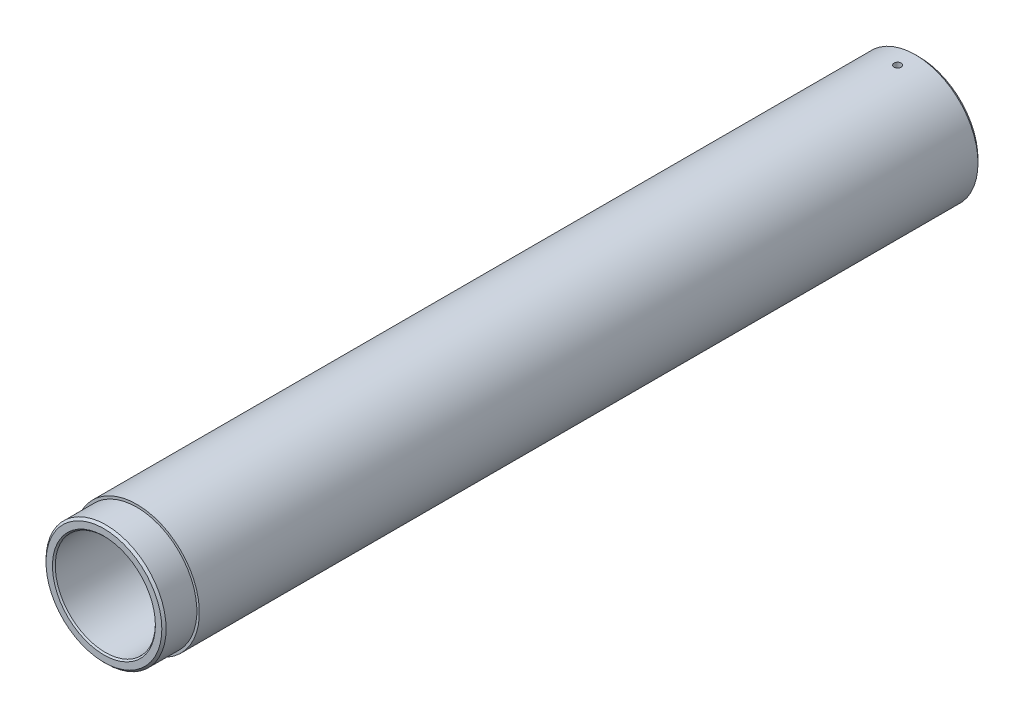
ISO-10303-21;
HEADER;
FILE_DESCRIPTION(('STEP AP214'),'2;1');
FILE_NAME('part.step','',(''),(''),'','','');
FILE_SCHEMA(('AUTOMOTIVE_DESIGN { 1 0 10303 214 1 1 1 1 }'));
ENDSEC;
DATA;
#1=APPLICATION_CONTEXT('core data for automotive mechanical design processes');
#2=APPLICATION_PROTOCOL_DEFINITION('international standard','automotive_design',2000,#1);
#3=PRODUCT_CONTEXT('',#1,'mechanical');
#4=PRODUCT('Part','Part','',(#3));
#5=PRODUCT_RELATED_PRODUCT_CATEGORY('part','',(#4));
#6=PRODUCT_DEFINITION_FORMATION('','',#4);
#7=PRODUCT_DEFINITION_CONTEXT('part definition',#1,'design');
#8=PRODUCT_DEFINITION('design','',#6,#7);
#9=PRODUCT_DEFINITION_SHAPE('','',#8);
#10=(LENGTH_UNIT() NAMED_UNIT(*) SI_UNIT(.MILLI.,.METRE.));
#11=(NAMED_UNIT(*) PLANE_ANGLE_UNIT() SI_UNIT($,.RADIAN.));
#12=(NAMED_UNIT(*) SI_UNIT($,.STERADIAN.) SOLID_ANGLE_UNIT());
#13=UNCERTAINTY_MEASURE_WITH_UNIT(LENGTH_MEASURE(1.E-05),#10,'distance_accuracy_value','');
#14=(GEOMETRIC_REPRESENTATION_CONTEXT(3) GLOBAL_UNCERTAINTY_ASSIGNED_CONTEXT((#13)) GLOBAL_UNIT_ASSIGNED_CONTEXT((#10,
#11,#12)) REPRESENTATION_CONTEXT('',''));
#15=CARTESIAN_POINT('',(0.,0.,0.));
#16=DIRECTION('',(0.,0.,1.));
#17=DIRECTION('',(1.,0.,0.));
#18=AXIS2_PLACEMENT_3D('',#15,#16,#17);
#19=CARTESIAN_POINT('',(0.,0.,570.));
#20=DIRECTION('',(0.,0.,-1.));
#21=DIRECTION('',(-1.,0.,0.));
#22=AXIS2_PLACEMENT_3D('',#19,#20,#21);
#23=CYLINDRICAL_SURFACE('',#22,87.5);
#24=CARTESIAN_POINT('',(0.,0.,524.));
#25=DIRECTION('',(0.,0.,-1.));
#26=DIRECTION('',(-1.,0.,0.));
#27=AXIS2_PLACEMENT_3D('',#24,#25,#26);
#28=CIRCLE('',#27,87.5);
#29=CARTESIAN_POINT('',(-87.5,0.,524.));
#30=VERTEX_POINT('',#29);
#31=EDGE_CURVE('E58',#30,#30,#28,.T.);
#32=ORIENTED_EDGE('',*,*,#31,.T.);
#33=EDGE_LOOP('',(#32));
#34=FACE_BOUND('',#33,.T.);
#35=CARTESIAN_POINT('',(0.,0.,-565.));
#36=DIRECTION('',(0.,0.,1.));
#37=DIRECTION('',(1.,0.,0.));
#38=AXIS2_PLACEMENT_3D('',#35,#36,#37);
#39=CIRCLE('',#38,87.5);
#40=CARTESIAN_POINT('',(87.5,0.,-565.));
#41=VERTEX_POINT('',#40);
#42=EDGE_CURVE('E65',#41,#41,#39,.T.);
#43=ORIENTED_EDGE('',*,*,#42,.T.);
#44=EDGE_LOOP('',(#43));
#45=FACE_BOUND('',#44,.T.);
#46=CARTESIAN_POINT('',(0.,87.5,-545.));
#47=CARTESIAN_POINT('',(-0.140353494550217,87.5000001774043,-545.000001124039));
#48=CARTESIAN_POINT('',(-0.280688984760301,87.4996615989778,-544.994087903597));
#49=CARTESIAN_POINT('',(-0.560407613455279,87.4983171222308,-544.970477140149));
#50=CARTESIAN_POINT('',(-0.699790499409025,87.4973110534035,-544.952776586127));
#51=CARTESIAN_POINT('',(-0.976683844110109,87.4946585732595,-544.905693568704));
#52=CARTESIAN_POINT('',(-1.11419258669591,87.4930116111499,-544.876301056581));
#53=CARTESIAN_POINT('',(-1.38628978360608,87.4891234424568,-544.806032748754));
#54=CARTESIAN_POINT('',(-1.52087715089463,87.4868820186418,-544.765152754901));
#55=CARTESIAN_POINT('',(-1.7860038916945,87.4818710139496,-544.672248253067));
#56=CARTESIAN_POINT('',(-1.91654675474242,87.4791019039896,-544.620233676731));
#57=CARTESIAN_POINT('',(-2.1728319210281,87.4731115202774,-544.505388606092));
#58=CARTESIAN_POINT('',(-2.29857243633945,87.4698900801691,-544.44255413056));
#59=CARTESIAN_POINT('',(-2.54423734439183,87.4630890673701,-544.306571164846));
#60=CARTESIAN_POINT('',(-2.66416519677498,87.4595097116922,-544.233428913634));
#61=CARTESIAN_POINT('',(-2.89748177823847,87.4520910554665,-544.077292049556));
#62=CARTESIAN_POINT('',(-3.01086807453722,87.4482516593499,-543.994293805929));
#63=CARTESIAN_POINT('',(-3.23033510419506,87.4404197373216,-543.818988660036));
#64=CARTESIAN_POINT('',(-3.33641027120848,87.4364270982611,-543.726674794225));
#65=CARTESIAN_POINT('',(-3.54044845710865,87.4284030249958,-543.533408816415));
#66=CARTESIAN_POINT('',(-3.63840846504481,87.4243715770056,-543.432453526203));
#67=CARTESIAN_POINT('',(-3.82544793728456,87.4163869654419,-543.222683407593));
#68=CARTESIAN_POINT('',(-3.91453029856233,87.4124337766704,-543.113871163215));
#69=CARTESIAN_POINT('',(-4.08325058983841,87.4047149841581,-542.889086513134));
#70=CARTESIAN_POINT('',(-4.16288502136678,87.4009494502014,-542.773111479146));
#71=CARTESIAN_POINT('',(-4.31212785487462,87.3937133880844,-542.534821899173));
#72=CARTESIAN_POINT('',(-4.38173321421385,87.3902429495811,-542.412505444555));
#73=CARTESIAN_POINT('',(-4.51041668601308,87.3836958117647,-542.162390199847));
#74=CARTESIAN_POINT('',(-4.5694908982243,87.3806192584469,-542.034589400262));
#75=CARTESIAN_POINT('',(-4.67663804600154,87.3749503227046,-541.774491795738));
#76=CARTESIAN_POINT('',(-4.72471511939977,87.3723577582402,-541.642196703433));
#77=CARTESIAN_POINT('',(-4.8095661786191,87.3677277405135,-541.374006233363));
#78=CARTESIAN_POINT('',(-4.84633599052424,87.3656904922698,-541.238109546178));
#79=CARTESIAN_POINT('',(-4.93913118657848,87.360511935829,-540.826860910999));
#80=CARTESIAN_POINT('',(-4.97787803270924,87.3582909187485,-540.547376653816));
#81=CARTESIAN_POINT('',(-5.00788652675383,87.3565753814524,-539.986014535367));
#82=CARTESIAN_POINT('',(-4.99914863810524,87.3570808346272,-539.704136697487));
#83=CARTESIAN_POINT('',(-4.93453967446561,87.3607540779416,-539.146151715721));
#84=CARTESIAN_POINT('',(-4.87872390909804,87.3639187438786,-538.87003818953));
#85=CARTESIAN_POINT('',(-4.72161290750819,87.3725500687875,-538.331116868728));
#86=CARTESIAN_POINT('',(-4.62031743532586,87.3780167397028,-538.068309143159));
#87=CARTESIAN_POINT('',(-4.37506384937826,87.3906392471769,-537.563268308152));
#88=CARTESIAN_POINT('',(-4.23108058156139,87.3977960791666,-537.321047438232));
#89=CARTESIAN_POINT('',(-3.9045556491673,87.4129914117525,-536.86419348496));
#90=CARTESIAN_POINT('',(-3.72201362461125,87.4210299205797,-536.649560659196));
#91=CARTESIAN_POINT('',(-3.32324131736048,87.4370965208609,-536.253652535492));
#92=CARTESIAN_POINT('',(-3.10696314154925,87.4451245808872,-536.072425472149));
#93=CARTESIAN_POINT('',(-2.64702587687849,87.4602544399251,-535.748845385997));
#94=CARTESIAN_POINT('',(-2.40336677983772,87.46735623866,-535.606492374802));
#95=CARTESIAN_POINT('',(-1.89555549675699,87.4798336994861,-535.364705530798));
#96=CARTESIAN_POINT('',(-1.63140247019284,87.4852092907333,-535.265273459417));
#97=CARTESIAN_POINT('',(-1.09011446967437,87.4936275597734,-535.112182929559));
#98=CARTESIAN_POINT('',(-0.812979622545285,87.4966702603522,-535.058524024001));
#99=CARTESIAN_POINT('',(-0.254013432563951,87.5000769266405,-534.998562621438));
#100=CARTESIAN_POINT('',(0.0278107330356192,87.5004446653747,-534.992193422197));
#101=CARTESIAN_POINT('',(0.588523611815352,87.4984699940475,-535.02681805084));
#102=CARTESIAN_POINT('',(0.867412337725762,87.4961275957442,-535.067811673238));
#103=CARTESIAN_POINT('',(1.41415026319905,87.4889988352532,-535.195943047866));
#104=CARTESIAN_POINT('',(1.68200664195568,87.4842140904479,-535.283050263948));
#105=CARTESIAN_POINT('',(2.19929779804261,87.4727391176563,-535.500905256772));
#106=CARTESIAN_POINT('',(2.4487324367336,87.4660488753315,-535.631653361909));
#107=CARTESIAN_POINT('',(2.92240543730271,87.4515056416428,-535.933248651841));
#108=CARTESIAN_POINT('',(3.14661534633045,87.4436513599519,-536.104140460145));
#109=CARTESIAN_POINT('',(3.56318801346395,87.4276685839583,-536.481108102829));
#110=CARTESIAN_POINT('',(3.75555050791195,87.4195400873861,-536.687184228463));
#111=CARTESIAN_POINT('',(4.10319360179103,87.4039141207669,-537.12895442646));
#112=CARTESIAN_POINT('',(4.25843098149149,87.3964173927112,-537.364682536329));
#113=CARTESIAN_POINT('',(4.52712021987337,87.3829123067106,-537.858907714874));
#114=CARTESIAN_POINT('',(4.64057230182332,87.3769039408131,-538.117404661882));
#115=CARTESIAN_POINT('',(4.82240092086781,87.3670577223577,-538.649618728996));
#116=CARTESIAN_POINT('',(4.89080481716648,87.3632185525794,-538.923326501335));
#117=CARTESIAN_POINT('',(4.98066406585461,87.3581427694404,-539.478517657249));
#118=CARTESIAN_POINT('',(5.00211979314427,87.3569061352975,-539.760000978715));
#119=CARTESIAN_POINT('',(4.99868835151569,87.3571004141498,-540.181450092026));
#120=CARTESIAN_POINT('',(4.99161313597053,87.3575064569968,-540.321778851262));
#121=CARTESIAN_POINT('',(4.96568948247667,87.3589842487839,-540.601327096313));
#122=CARTESIAN_POINT('',(4.94684539803986,87.3600557515579,-540.740546973044));
#123=CARTESIAN_POINT('',(4.89750474147686,87.3628356234173,-541.016942811073));
#124=CARTESIAN_POINT('',(4.86700386267354,87.3645442278783,-541.154117997462));
#125=CARTESIAN_POINT('',(4.79458459869491,87.3685485405066,-541.42536032351));
#126=CARTESIAN_POINT('',(4.75267041701051,87.3708440325058,-541.559428587753));
#127=CARTESIAN_POINT('',(4.65770108190452,87.3759582508288,-541.823603817628));
#128=CARTESIAN_POINT('',(4.6046418497217,87.3787771686672,-541.953709312987));
#129=CARTESIAN_POINT('',(4.48779192705564,87.3848564855314,-542.208939845635));
#130=CARTESIAN_POINT('',(4.42400518896496,87.3881167218738,-542.334066696312));
#131=CARTESIAN_POINT('',(4.2861167519848,87.3949882279554,-542.578547249043));
#132=CARTESIAN_POINT('',(4.21201157356913,87.3985996159835,-542.697898985274));
#133=CARTESIAN_POINT('',(4.05405763185545,87.4060687996387,-542.929898087627));
#134=CARTESIAN_POINT('',(3.97021245415048,87.409926504355,-543.042547897985));
#135=CARTESIAN_POINT('',(3.79320037441526,87.4177870346197,-543.260580000854));
#136=CARTESIAN_POINT('',(3.70001797174803,87.4217900942055,-543.365949701034));
#137=CARTESIAN_POINT('',(3.50514634048114,87.4298201564252,-543.56842894715));
#138=CARTESIAN_POINT('',(3.40346025200853,87.4338471497153,-543.665541515687));
#139=CARTESIAN_POINT('',(3.19220608866852,87.4418149234529,-543.850919455395));
#140=CARTESIAN_POINT('',(3.08263320831804,87.4457556493972,-543.939179352831));
#141=CARTESIAN_POINT('',(2.85647879558645,87.4534351680839,-544.106126645556));
#142=CARTESIAN_POINT('',(2.7398998631756,87.457174034771,-544.184817559549));
#143=CARTESIAN_POINT('',(2.50034444609276,87.4643507687863,-544.332214765239));
#144=CARTESIAN_POINT('',(2.3773587458016,87.467788182312,-544.400906102947));
#145=CARTESIAN_POINT('',(2.12606982304713,87.4742568815573,-544.527650954462));
#146=CARTESIAN_POINT('',(1.99776856396576,87.4772883155109,-544.585708353871));
#147=CARTESIAN_POINT('',(1.73682903814133,87.4828579489435,-544.690755453468));
#148=CARTESIAN_POINT('',(1.60419463651506,87.4853965746865,-544.737754726128));
#149=CARTESIAN_POINT('',(1.33547288403443,87.4899112686366,-544.820401731433));
#150=CARTESIAN_POINT('',(1.19938643096779,87.4918874815114,-544.856052383528));
#151=CARTESIAN_POINT('',(0.887753200527499,87.4956697720622,-544.923787487865));
#152=CARTESIAN_POINT('',(0.711425618028075,87.4972875701508,-544.952341906901));
#153=CARTESIAN_POINT('',(0.356722331786841,87.4994525707976,-544.990447438011));
#154=CARTESIAN_POINT('',(0.178346630373542,87.499999774573,-544.999998571688));
#155=CARTESIAN_POINT('',(0.,87.5,-545.));
#156=B_SPLINE_CURVE_WITH_KNOTS('',3,(#46,#47,#48,#49,#50,#51,#52,#53,#54,#55,#56,#57,#58,#59,
#60,#61,#62,#63,#64,#65,#66,#67,#68,#69,#70,#71,#72,#73,#74,#75,#76,#77,#78,#79,#80,#81,#82,#83,
#84,#85,#86,#87,#88,#89,#90,#91,#92,#93,#94,#95,#96,#97,#98,#99,#100,#101,#102,#103,#104,#105,
#106,#107,#108,#109,#110,#111,#112,#113,#114,#115,#116,#117,#118,#119,#120,#121,#122,#123,#124,
#125,#126,#127,#128,#129,#130,#131,#132,#133,#134,#135,#136,#137,#138,#139,#140,#141,#142,#143,
#144,#145,#146,#147,#148,#149,#150,#151,#152,#153,#154,#155),.UNSPECIFIED.,.T.,.F.,(4,2,2,2,2,2,
2,2,2,2,2,2,2,2,2,2,2,2,2,2,2,2,2,2,2,2,2,2,2,2,2,2,2,2,2,2,2,2,2,2,2,2,2,2,2,2,2,2,2,2,2,2,2,2,
4),(0.,0.420904645376287,0.841916850033855,1.2632916805754,1.68482070503997,2.10597529595064,
2.52728518496749,2.9483411549801,3.36955271799029,3.79108150771636,4.21276600237754,
4.63431243827221,5.05601448443104,5.47784419923929,5.89982981712417,6.32165639468539,
6.74363849717512,7.58576503284785,8.42788334961852,9.26901367634905,10.1101483671239,
10.9517796902503,11.793418871069,12.6362639353429,13.4791092514538,14.3219891537456,
15.1648608232818,16.0065433941856,16.8482223134227,17.6893445737594,18.5304731636138,
19.3725412089347,20.2146162252038,21.0576668343238,21.9007129387636,22.7432465609966,
23.5857734552318,24.0068866665485,24.4278441928636,24.8489573952092,25.2699157118976,
25.691028356227,26.1119861863089,26.533086314755,26.9540319116491,27.3756882728908,
27.7971896123011,28.2189499860274,28.6405547981074,29.0627837661643,29.4848581442184,
29.9065657980424,30.3281648790573,30.8630073551029,31.3978492231447),.UNSPECIFIED.);
#157=CARTESIAN_POINT('',(0.,87.5,-545.));
#158=VERTEX_POINT('',#157);
#159=EDGE_CURVE('E72',#158,#158,#156,.T.);
#160=ORIENTED_EDGE('',*,*,#159,.F.);
#161=EDGE_LOOP('',(#160));
#162=FACE_BOUND('',#161,.T.);
#163=ADVANCED_FACE('F32',(#34,#45,#162),#23,.T.);
#164=CARTESIAN_POINT('',(0.,0.,570.));
#165=DIRECTION('',(0.,0.,-1.));
#166=DIRECTION('',(-1.,0.,0.));
#167=AXIS2_PLACEMENT_3D('',#164,#165,#166);
#168=CYLINDRICAL_SURFACE('',#167,70.);
#169=CARTESIAN_POINT('',(0.,0.,-570.));
#170=DIRECTION('',(0.,0.,1.));
#171=DIRECTION('',(1.,0.,0.));
#172=AXIS2_PLACEMENT_3D('',#169,#170,#171);
#173=CIRCLE('',#172,70.);
#174=CARTESIAN_POINT('',(70.,0.,-570.));
#175=VERTEX_POINT('',#174);
#176=EDGE_CURVE('E61',#175,#175,#173,.T.);
#177=ORIENTED_EDGE('',*,*,#176,.F.);
#178=EDGE_LOOP('',(#177));
#179=FACE_BOUND('',#178,.T.);
#180=CARTESIAN_POINT('',(0.,0.,568.));
#181=DIRECTION('',(0.,0.,1.));
#182=DIRECTION('',(1.,0.,0.));
#183=AXIS2_PLACEMENT_3D('',#180,#181,#182);
#184=CIRCLE('',#183,70.);
#185=CARTESIAN_POINT('',(70.,0.,568.));
#186=VERTEX_POINT('',#185);
#187=EDGE_CURVE('E45',#186,#186,#184,.T.);
#188=ORIENTED_EDGE('',*,*,#187,.T.);
#189=EDGE_LOOP('',(#188));
#190=FACE_BOUND('',#189,.T.);
#191=CARTESIAN_POINT('',(0.,70.,-545.));
#192=CARTESIAN_POINT('',(-0.140284355117039,70.0000002339568,-545.000001191231));
#193=CARTESIAN_POINT('',(-0.280549882095459,69.9995774220994,-544.994093763169));
#194=CARTESIAN_POINT('',(-0.560128091603476,69.9978984856483,-544.97050660729));
#195=CARTESIAN_POINT('',(-0.699440525850233,69.9966421516901,-544.952823921755));
#196=CARTESIAN_POINT('',(-0.976190099008069,69.993329853636,-544.905789673813));
#197=CARTESIAN_POINT('',(-1.11362555564529,69.9912732154386,-544.876428273886));
#198=CARTESIAN_POINT('',(-1.38557657629033,69.9864178239072,-544.806236065325));
#199=CARTESIAN_POINT('',(-1.52009105309621,69.9836187992073,-544.765401062402));
#200=CARTESIAN_POINT('',(-1.78507058079349,69.9773611437192,-544.672602253431));
#201=CARTESIAN_POINT('',(-1.91553921432633,69.9739031170728,-544.620648635077));
#202=CARTESIAN_POINT('',(-2.17167993751433,69.966422163416,-544.505941067952));
#203=CARTESIAN_POINT('',(-2.29735024057834,69.9623990285545,-544.443183143349));
#204=CARTESIAN_POINT('',(-2.54288259944837,69.9539050466315,-544.307368042786));
#205=CARTESIAN_POINT('',(-2.66274806317434,69.9494344671034,-544.234317010688));
#206=CARTESIAN_POINT('',(-2.89594971367939,69.9401680022373,-544.078376838379));
#207=CARTESIAN_POINT('',(-3.00928346960371,69.9353719972158,-543.995484070119));
#208=CARTESIAN_POINT('',(-3.22872099306615,69.9255850292263,-543.820352440332));
#209=CARTESIAN_POINT('',(-3.33481499951329,69.9205938167854,-543.72810136211));
#210=CARTESIAN_POINT('',(-3.53889731639166,69.9105617924096,-543.534961283971));
#211=CARTESIAN_POINT('',(-3.63688261767336,69.9055209628312,-543.434069105346));
#212=CARTESIAN_POINT('',(-3.82398059835377,69.8955359722354,-543.224423222043));
#213=CARTESIAN_POINT('',(-3.91309615964475,69.8905917802415,-543.115672090791));
#214=CARTESIAN_POINT('',(-4.08189129562262,69.8809367067669,-542.891005492784));
#215=CARTESIAN_POINT('',(-4.16156737533791,69.8762259120749,-542.775087396481));
#216=CARTESIAN_POINT('',(-4.31093123788779,69.8671702369243,-542.536858316423));
#217=CARTESIAN_POINT('',(-4.38061203481137,69.8628256132566,-542.414542942171));
#218=CARTESIAN_POINT('',(-4.50944548076715,69.8546281188111,-542.164417351933));
#219=CARTESIAN_POINT('',(-4.56859422685782,69.8507754304826,-542.036605120629));
#220=CARTESIAN_POINT('',(-4.67588740144158,69.8436752807447,-541.776472302552));
#221=CARTESIAN_POINT('',(-4.72403600515837,69.8404275897887,-541.644153448304));
#222=CARTESIAN_POINT('',(-4.80902521972931,69.8346265310674,-541.375903456503));
#223=CARTESIAN_POINT('',(-4.84586165814716,69.8320734195338,-541.239971006132));
#224=CARTESIAN_POINT('',(-4.93880754226021,69.8255845677466,-540.828769035153));
#225=CARTESIAN_POINT('',(-4.97765671177825,69.8227985607691,-540.549357800304));
#226=CARTESIAN_POINT('',(-5.00788876598371,69.8206362353265,-539.988119183616));
#227=CARTESIAN_POINT('',(-4.99927232710657,69.8212598682704,-539.706291836267));
#228=CARTESIAN_POINT('',(-4.93494553983131,69.8258357528666,-539.14858117641));
#229=CARTESIAN_POINT('',(-4.87932177148593,69.8297818849525,-538.872687891646));
#230=CARTESIAN_POINT('',(-4.72267718758765,69.8405500259556,-538.33417480592));
#231=CARTESIAN_POINT('',(-4.62165603227896,69.8473720563961,-538.071555104314));
#232=CARTESIAN_POINT('',(-4.37699091500563,69.8631298859935,-537.566753345916));
#233=CARTESIAN_POINT('',(-4.23330783734093,69.8720676234604,-537.324590308231));
#234=CARTESIAN_POINT('',(-3.90742460831437,69.8910479518556,-536.867787523585));
#235=CARTESIAN_POINT('',(-3.72522388714125,69.9010905591277,-536.653148183872));
#236=CARTESIAN_POINT('',(-3.32699072993658,69.9211761538958,-536.256980915976));
#237=CARTESIAN_POINT('',(-3.11088337579789,69.9312190917869,-536.075528285184));
#238=CARTESIAN_POINT('',(-2.65123349470932,69.9501521096995,-535.751466810216));
#239=CARTESIAN_POINT('',(-2.40769095516013,69.9590421891914,-535.608857983878));
#240=CARTESIAN_POINT('',(-1.90003703768705,69.9746688297383,-535.366537895176));
#241=CARTESIAN_POINT('',(-1.63592420267941,69.9814052380665,-535.26682967492));
#242=CARTESIAN_POINT('',(-1.09464808626866,69.9919635682386,-535.113192415807));
#243=CARTESIAN_POINT('',(-0.817485003921821,69.9957855345213,-535.059262678926));
#244=CARTESIAN_POINT('',(-0.258629087428356,70.0000786148132,-534.998806983249));
#245=CARTESIAN_POINT('',(0.0230524349860733,70.0005570849878,-534.99217695771));
#246=CARTESIAN_POINT('',(0.583523340903628,69.9981288582326,-535.026236704031));
#247=CARTESIAN_POINT('',(0.862312744126173,69.9952221843993,-535.066926153038));
#248=CARTESIAN_POINT('',(1.4087910445011,69.9863554876944,-535.194383603289));
#249=CARTESIAN_POINT('',(1.67649117863059,69.9803986417018,-535.281103665203));
#250=CARTESIAN_POINT('',(2.19353923769791,69.9661013666788,-535.498111955106));
#251=CARTESIAN_POINT('',(2.4428869477611,69.9577609097461,-535.628400693109));
#252=CARTESIAN_POINT('',(2.91662751942188,69.9396143520429,-535.929111230793));
#253=CARTESIAN_POINT('',(3.14097630497889,69.9298057318852,-536.099602313375));
#254=CARTESIAN_POINT('',(3.55790630302107,69.909834470225,-536.475778382968));
#255=CARTESIAN_POINT('',(3.75048710913218,69.8996718241956,-536.681463820113));
#256=CARTESIAN_POINT('',(4.09876916285791,69.8801163299114,-537.122636224925));
#257=CARTESIAN_POINT('',(4.25440274058345,69.8707249144445,-537.358176681404));
#258=CARTESIAN_POINT('',(4.52390769476742,69.8537942866992,-537.852119162709));
#259=CARTESIAN_POINT('',(4.63777939221992,69.8462550601844,-538.110521011798));
#260=CARTESIAN_POINT('',(4.82041723056124,69.8338885414538,-538.64255480967));
#261=CARTESIAN_POINT('',(4.88922549821688,69.829058717008,-538.91617227399));
#262=CARTESIAN_POINT('',(4.9799002546576,69.8226521819494,-539.47126551722));
#263=CARTESIAN_POINT('',(5.00176737998039,69.8210754272237,-539.752741189518));
#264=CARTESIAN_POINT('',(4.99894637932733,69.8212747845371,-540.174115186221));
#265=CARTESIAN_POINT('',(4.9920834776644,69.8217676173515,-540.314351642802));
#266=CARTESIAN_POINT('',(4.96660030962093,69.823585392347,-540.59373274245));
#267=CARTESIAN_POINT('',(4.94798439524838,69.8249100265203,-540.732877770362));
#268=CARTESIAN_POINT('',(4.89911508529293,69.8283557137569,-541.009141698817));
#269=CARTESIAN_POINT('',(4.86885739808073,69.8304770605138,-541.146259832786));
#270=CARTESIAN_POINT('',(4.79693858761137,69.8354543184909,-541.417407066047));
#271=CARTESIAN_POINT('',(4.75528165475211,69.838309959759,-541.551437280878));
#272=CARTESIAN_POINT('',(4.66084142555811,69.844676212985,-541.815553384315));
#273=CARTESIAN_POINT('',(4.60805434344766,69.8481870477519,-541.945637913583));
#274=CARTESIAN_POINT('',(4.49176117815976,69.8557619210469,-542.200849452315));
#275=CARTESIAN_POINT('',(4.42825903409431,69.8598257561731,-542.325978262821));
#276=CARTESIAN_POINT('',(4.29095025190657,69.8683939761117,-542.570488772632));
#277=CARTESIAN_POINT('',(4.21714009160615,69.8728985113501,-542.68986848868));
#278=CARTESIAN_POINT('',(4.05978390779851,69.8822177782245,-542.921951992291));
#279=CARTESIAN_POINT('',(3.97624145515173,69.8870323958006,-543.034658205669));
#280=CARTESIAN_POINT('',(3.79976911442811,69.8968495779651,-543.252921594454));
#281=CARTESIAN_POINT('',(3.70681638615491,69.9018525803881,-543.358460284186));
#282=CARTESIAN_POINT('',(3.51239082339141,69.9118915482573,-543.561297462168));
#283=CARTESIAN_POINT('',(3.41092112758837,69.9169275009353,-543.65859895968));
#284=CARTESIAN_POINT('',(3.20008371514261,69.9268947257744,-543.844374782555));
#285=CARTESIAN_POINT('',(3.09071119715312,69.9318259319026,-543.932843662612));
#286=CARTESIAN_POINT('',(2.86493776897181,69.9414390096038,-544.100228314838));
#287=CARTESIAN_POINT('',(2.74853946696719,69.9461209725036,-544.179147599814));
#288=CARTESIAN_POINT('',(2.50927818859804,69.9551133091797,-544.327047411305));
#289=CARTESIAN_POINT('',(2.38640363743918,69.9594229786207,-544.39600925809));
#290=CARTESIAN_POINT('',(2.13530772732491,69.9675369909911,-544.52330272972));
#291=CARTESIAN_POINT('',(2.00708834396872,69.9713415184967,-544.581638240285));
#292=CARTESIAN_POINT('',(1.74628056181557,69.9783359444628,-544.687246367659));
#293=CARTESIAN_POINT('',(1.61369599831814,69.981526366453,-544.734528415075));
#294=CARTESIAN_POINT('',(1.34504380207763,69.9872053517076,-544.817741409004));
#295=CARTESIAN_POINT('',(1.20897706368885,69.9896940932555,-544.853675239157));
#296=CARTESIAN_POINT('',(0.895830160604704,69.9944880319973,-544.92238363551));
#297=CARTESIAN_POINT('',(0.717923237178654,69.9965471963651,-544.951463435736));
#298=CARTESIAN_POINT('',(0.360000542292472,69.9993030290148,-544.990270835791));
#299=CARTESIAN_POINT('',(0.179984774759402,69.9999996998335,-544.999998471651));
#300=CARTESIAN_POINT('',(0.,70.,-545.));
#301=B_SPLINE_CURVE_WITH_KNOTS('',3,(#191,#192,#193,#194,#195,#196,#197,#198,#199,#200,#201,
#202,#203,#204,#205,#206,#207,#208,#209,#210,#211,#212,#213,#214,#215,#216,#217,#218,#219,#220,
#221,#222,#223,#224,#225,#226,#227,#228,#229,#230,#231,#232,#233,#234,#235,#236,#237,#238,#239,
#240,#241,#242,#243,#244,#245,#246,#247,#248,#249,#250,#251,#252,#253,#254,#255,#256,#257,#258,
#259,#260,#261,#262,#263,#264,#265,#266,#267,#268,#269,#270,#271,#272,#273,#274,#275,#276,#277,
#278,#279,#280,#281,#282,#283,#284,#285,#286,#287,#288,#289,#290,#291,#292,#293,#294,#295,#296,
#297,#298,#299,#300),.UNSPECIFIED.,.T.,.F.,(4,2,2,2,2,2,2,2,2,2,2,2,2,2,2,2,2,2,2,2,2,2,2,2,2,2,
2,2,2,2,2,2,2,2,2,2,2,2,2,2,2,2,2,2,2,2,2,2,2,2,2,2,2,2,4),(0.,0.420695762835035,
0.841497236247813,1.26265392339547,1.68396476935889,2.10489121961112,2.52597289723763,
2.94680429146603,3.36779130509314,3.78933514168989,4.21103471863689,4.63259682961206,
5.05431453953148,5.47632557539819,5.89849267507237,6.32049926942667,6.74266133238994,
7.58462392432249,8.42657451742277,9.26697774221195,10.1073872567159,10.9485697147298,
11.7897646176582,12.632845052679,13.4759258748769,14.3190664705751,15.1621942099587,
16.0034663631187,16.8447327764337,17.6851247532992,18.525526568114,19.3673874169982,
20.2092590340802,21.0526608679322,21.8960562190143,22.7386620068534,23.581256368602,
24.0020625134367,24.4227129298209,24.8435185638019,25.2641697156543,25.6849641780123,
26.1056042819968,26.5263884690771,26.9470187502715,27.3686956250933,27.7902177794323,
28.2119982178156,28.6336230300031,29.056028792839,29.4782797836347,29.9001691921853,
30.3219513100093,30.8617048201806,31.40145732539),.UNSPECIFIED.);
#302=CARTESIAN_POINT('',(0.,70.,-545.));
#303=VERTEX_POINT('',#302);
#304=EDGE_CURVE('E36',#303,#303,#301,.T.);
#305=ORIENTED_EDGE('',*,*,#304,.T.);
#306=EDGE_LOOP('',(#305));
#307=FACE_BOUND('',#306,.T.);
#308=ADVANCED_FACE('F96',(#179,#190,#307),#168,.F.);
#309=CARTESIAN_POINT('',(0.,0.,570.));
#310=DIRECTION('',(0.,0.,1.));
#311=DIRECTION('',(1.,0.,0.));
#312=AXIS2_PLACEMENT_3D('',#309,#310,#311);
#313=PLANE('',#312);
#314=CARTESIAN_POINT('',(0.,0.,570.));
#315=DIRECTION('',(0.,0.,1.));
#316=DIRECTION('',(1.,0.,0.));
#317=AXIS2_PLACEMENT_3D('',#314,#315,#316);
#318=CIRCLE('',#317,72.);
#319=CARTESIAN_POINT('',(72.,0.,570.));
#320=VERTEX_POINT('',#319);
#321=EDGE_CURVE('E10',#320,#320,#318,.F.);
#322=ORIENTED_EDGE('',*,*,#321,.T.);
#323=EDGE_LOOP('',(#322));
#324=FACE_BOUND('',#323,.T.);
#325=CARTESIAN_POINT('',(0.,0.,570.));
#326=DIRECTION('',(0.,0.,1.));
#327=DIRECTION('',(1.,0.,0.));
#328=AXIS2_PLACEMENT_3D('',#325,#326,#327);
#329=CIRCLE('',#328,80.9999999999998);
#330=CARTESIAN_POINT('',(80.9999999999998,0.,570.));
#331=VERTEX_POINT('',#330);
#332=EDGE_CURVE('E49',#331,#331,#329,.T.);
#333=ORIENTED_EDGE('',*,*,#332,.T.);
#334=EDGE_LOOP('',(#333));
#335=FACE_BOUND('',#334,.T.);
#336=ADVANCED_FACE('F100',(#324,#335),#313,.T.);
#337=CARTESIAN_POINT('',(0.,0.,-570.));
#338=DIRECTION('',(0.,0.,1.));
#339=DIRECTION('',(1.,0.,0.));
#340=AXIS2_PLACEMENT_3D('',#337,#338,#339);
#341=PLANE('',#340);
#342=CARTESIAN_POINT('',(0.,0.,-570.));
#343=DIRECTION('',(0.,0.,1.));
#344=DIRECTION('',(1.,0.,0.));
#345=AXIS2_PLACEMENT_3D('',#342,#343,#344);
#346=CIRCLE('',#345,82.5000000000001);
#347=CARTESIAN_POINT('',(82.5000000000001,0.,-570.));
#348=VERTEX_POINT('',#347);
#349=EDGE_CURVE('E57',#348,#348,#346,.F.);
#350=ORIENTED_EDGE('',*,*,#349,.T.);
#351=EDGE_LOOP('',(#350));
#352=FACE_BOUND('',#351,.T.);
#353=ORIENTED_EDGE('',*,*,#176,.T.);
#354=EDGE_LOOP('',(#353));
#355=FACE_BOUND('',#354,.T.);
#356=ADVANCED_FACE('F103',(#352,#355),#341,.F.);
#357=CARTESIAN_POINT('',(0.,0.,-565.));
#358=DIRECTION('',(0.,0.,1.));
#359=DIRECTION('',(1.,0.,0.));
#360=AXIS2_PLACEMENT_3D('',#357,#358,#359);
#361=CONICAL_SURFACE('',#360,87.5,0.785398163397446);
#362=ORIENTED_EDGE('',*,*,#349,.F.);
#363=EDGE_LOOP('',(#362));
#364=FACE_BOUND('',#363,.T.);
#365=ORIENTED_EDGE('',*,*,#42,.F.);
#366=EDGE_LOOP('',(#365));
#367=FACE_BOUND('',#366,.T.);
#368=ADVANCED_FACE('F91',(#364,#367),#361,.T.);
#369=CARTESIAN_POINT('',(0.,107.271648670706,524.));
#370=DIRECTION('',(0.,0.,-1.));
#371=DIRECTION('',(-1.,0.,0.));
#372=AXIS2_PLACEMENT_3D('',#369,#370,#371);
#373=PLANE('',#372);
#374=CARTESIAN_POINT('',(0.,0.,524.));
#375=DIRECTION('',(0.,0.,-1.));
#376=DIRECTION('',(-1.,0.,0.));
#377=AXIS2_PLACEMENT_3D('',#374,#375,#376);
#378=CIRCLE('',#377,83.9999999999999);
#379=CARTESIAN_POINT('',(-83.9999999999999,0.,524.));
#380=VERTEX_POINT('',#379);
#381=EDGE_CURVE('E62',#380,#380,#378,.T.);
#382=ORIENTED_EDGE('',*,*,#381,.T.);
#383=EDGE_LOOP('',(#382));
#384=FACE_BOUND('',#383,.T.);
#385=ORIENTED_EDGE('',*,*,#31,.F.);
#386=EDGE_LOOP('',(#385));
#387=FACE_BOUND('',#386,.T.);
#388=ADVANCED_FACE('F86',(#384,#387),#373,.F.);
#389=CARTESIAN_POINT('',(0.,0.,0.));
#390=DIRECTION('',(0.,0.,-1.));
#391=DIRECTION('',(-1.,0.,0.));
#392=AXIS2_PLACEMENT_3D('',#389,#390,#391);
#393=CYLINDRICAL_SURFACE('',#392,83.9999999999999);
#394=CARTESIAN_POINT('',(0.,0.,567.));
#395=DIRECTION('',(0.,0.,1.));
#396=DIRECTION('',(1.,0.,0.));
#397=AXIS2_PLACEMENT_3D('',#394,#395,#396);
#398=CIRCLE('',#397,83.9999999999999);
#399=CARTESIAN_POINT('',(83.9999999999999,0.,567.));
#400=VERTEX_POINT('',#399);
#401=EDGE_CURVE('E54',#400,#400,#398,.F.);
#402=ORIENTED_EDGE('',*,*,#401,.T.);
#403=EDGE_LOOP('',(#402));
#404=FACE_BOUND('',#403,.T.);
#405=ORIENTED_EDGE('',*,*,#381,.F.);
#406=EDGE_LOOP('',(#405));
#407=FACE_BOUND('',#406,.T.);
#408=ADVANCED_FACE('F90',(#404,#407),#393,.T.);
#409=CARTESIAN_POINT('',(0.,0.,567.));
#410=DIRECTION('',(0.,0.,-1.));
#411=DIRECTION('',(-1.,0.,0.));
#412=AXIS2_PLACEMENT_3D('',#409,#410,#411);
#413=CONICAL_SURFACE('',#412,83.9999999999999,0.785398163397462);
#414=ORIENTED_EDGE('',*,*,#332,.F.);
#415=EDGE_LOOP('',(#414));
#416=FACE_BOUND('',#415,.T.);
#417=ORIENTED_EDGE('',*,*,#401,.F.);
#418=EDGE_LOOP('',(#417));
#419=FACE_BOUND('',#418,.T.);
#420=ADVANCED_FACE('F94',(#416,#419),#413,.T.);
#421=CARTESIAN_POINT('',(0.,0.,568.));
#422=DIRECTION('',(0.,0.,1.));
#423=DIRECTION('',(1.,0.,0.));
#424=AXIS2_PLACEMENT_3D('',#421,#422,#423);
#425=CONICAL_SURFACE('',#424,70.,0.785398163397459);
#426=ORIENTED_EDGE('',*,*,#321,.F.);
#427=EDGE_LOOP('',(#426));
#428=FACE_BOUND('',#427,.T.);
#429=ORIENTED_EDGE('',*,*,#187,.F.);
#430=EDGE_LOOP('',(#429));
#431=FACE_BOUND('',#430,.T.);
#432=ADVANCED_FACE('F34',(#428,#431),#425,.F.);
#433=CARTESIAN_POINT('',(0.,102.,-540.));
#434=DIRECTION('',(0.,-1.,0.));
#435=DIRECTION('',(0.,0.,-1.));
#436=AXIS2_PLACEMENT_3D('',#433,#434,#435);
#437=CYLINDRICAL_SURFACE('',#436,5.00000000000001);
#438=ORIENTED_EDGE('',*,*,#304,.F.);
#439=EDGE_LOOP('',(#438));
#440=FACE_BOUND('',#439,.T.);
#441=ORIENTED_EDGE('',*,*,#159,.T.);
#442=EDGE_LOOP('',(#441));
#443=FACE_BOUND('',#442,.T.);
#444=ADVANCED_FACE('F81',(#440,#443),#437,.F.);
#445=CLOSED_SHELL('',(#163,#308,#336,#356,#368,#388,#408,#420,#432,#444));
#446=MANIFOLD_SOLID_BREP('B2',#445);
#447=ADVANCED_BREP_SHAPE_REPRESENTATION('',(#18,#446),#14);
#448=SHAPE_DEFINITION_REPRESENTATION(#9,#447);
ENDSEC;
END-ISO-10303-21;
